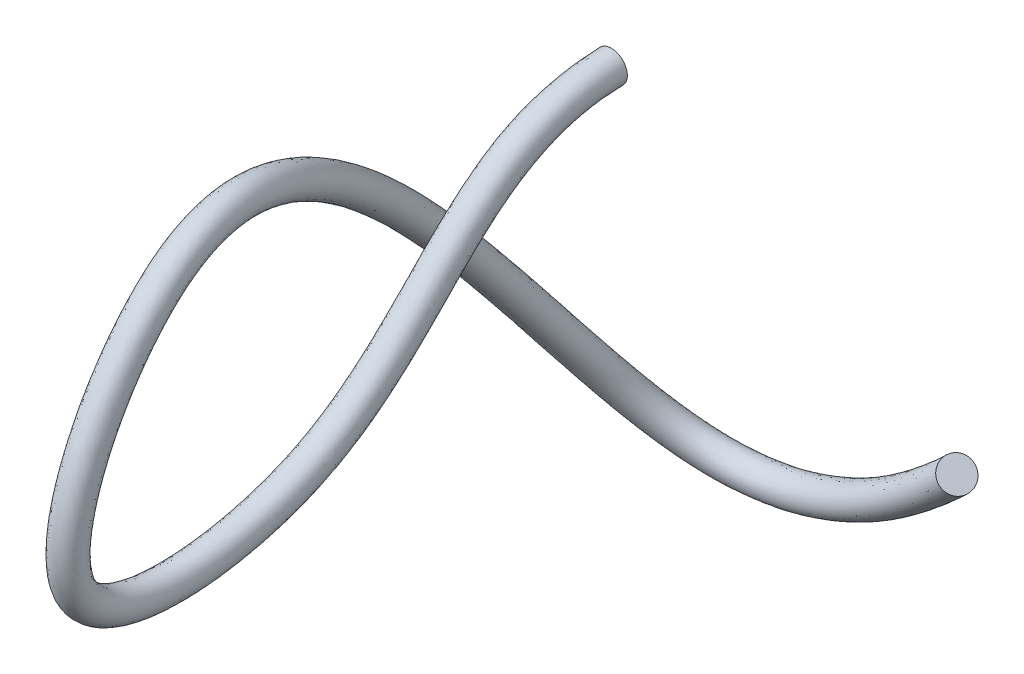
ISO-10303-21;
HEADER;
FILE_DESCRIPTION(('STEP AP214'),'2;1');
FILE_NAME('part.step','',(''),(''),'','','');
FILE_SCHEMA(('AUTOMOTIVE_DESIGN { 1 0 10303 214 1 1 1 1 }'));
ENDSEC;
DATA;
#1=APPLICATION_CONTEXT('core data for automotive mechanical design processes');
#2=APPLICATION_PROTOCOL_DEFINITION('international standard','automotive_design',2000,#1);
#3=PRODUCT_CONTEXT('',#1,'mechanical');
#4=PRODUCT('Part','Part','',(#3));
#5=PRODUCT_RELATED_PRODUCT_CATEGORY('part','',(#4));
#6=PRODUCT_DEFINITION_FORMATION('','',#4);
#7=PRODUCT_DEFINITION_CONTEXT('part definition',#1,'design');
#8=PRODUCT_DEFINITION('design','',#6,#7);
#9=PRODUCT_DEFINITION_SHAPE('','',#8);
#10=(LENGTH_UNIT() NAMED_UNIT(*) SI_UNIT(.MILLI.,.METRE.));
#11=(NAMED_UNIT(*) PLANE_ANGLE_UNIT() SI_UNIT($,.RADIAN.));
#12=(NAMED_UNIT(*) SI_UNIT($,.STERADIAN.) SOLID_ANGLE_UNIT());
#13=UNCERTAINTY_MEASURE_WITH_UNIT(LENGTH_MEASURE(1.E-05),#10,'distance_accuracy_value','');
#14=(GEOMETRIC_REPRESENTATION_CONTEXT(3) GLOBAL_UNCERTAINTY_ASSIGNED_CONTEXT((#13)) GLOBAL_UNIT_ASSIGNED_CONTEXT((#10,
#11,#12)) REPRESENTATION_CONTEXT('',''));
#15=CARTESIAN_POINT('',(0.,0.,0.));
#16=DIRECTION('',(0.,0.,1.));
#17=DIRECTION('',(1.,0.,0.));
#18=AXIS2_PLACEMENT_3D('',#15,#16,#17);
#19=CARTESIAN_POINT('',(335.309726891011,-178.374330476018,-1.599378925278));
#20=DIRECTION('',(0.690028986622815,0.673712878655407,0.264520235056103));
#21=DIRECTION('',(0.723689115795958,-0.636366354079352,-0.267042931144447));
#22=AXIS2_PLACEMENT_3D('',#19,#20,#21);
#23=PLANE('',#22);
#24=CARTESIAN_POINT('',(335.309726891011,-178.374330476018,-1.599378925278));
#25=DIRECTION('',(0.690028986622815,0.673712878655407,0.264520235056103));
#26=DIRECTION('',(0.723689115795958,-0.636366354079352,-0.267042931144447));
#27=AXIS2_PLACEMENT_3D('',#24,#25,#26);
#28=CIRCLE('',#27,15.308456730718);
#29=CARTESIAN_POINT('',(346.388290406665,-188.116117272327,-5.68739408194688));
#30=VERTEX_POINT('',#29);
#31=EDGE_CURVE('E42',#30,#30,#28,.T.);
#32=ORIENTED_EDGE('',*,*,#31,.T.);
#33=EDGE_LOOP('',(#32));
#34=FACE_BOUND('',#33,.T.);
#35=ADVANCED_FACE('F39',(#34),#23,.T.);
#36=CARTESIAN_POINT('',(0.,0.,0.));
#37=DIRECTION('',(-0.00204290912862575,-0.0240600520342784,0.999708427701998));
#38=DIRECTION('',(0.,-0.999710513838946,-0.024060102241481));
#39=AXIS2_PLACEMENT_3D('',#36,#37,#38);
#40=PLANE('',#39);
#41=CARTESIAN_POINT('',(0.,0.,0.));
#42=DIRECTION('',(-0.00204290912862575,-0.0240600520342784,0.999708427701998));
#43=DIRECTION('',(0.,-0.999710513838946,-0.024060102241481));
#44=AXIS2_PLACEMENT_3D('',#41,#42,#43);
#45=CIRCLE('',#44,15.308456730718);
#46=CARTESIAN_POINT('',(0.,-15.3040251443474,-0.368323034100364));
#47=VERTEX_POINT('',#46);
#48=EDGE_CURVE('E11',#47,#47,#45,.T.);
#49=ORIENTED_EDGE('',*,*,#48,.F.);
#50=EDGE_LOOP('',(#49));
#51=FACE_BOUND('',#50,.T.);
#52=ADVANCED_FACE('F54',(#51),#40,.F.);
#53=CARTESIAN_POINT('',(0.,-15.3040251443474,-0.368323034100364));
#54=CARTESIAN_POINT('',(-0.0488518499919421,-15.8793703891785,23.5375891092513));
#55=CARTESIAN_POINT('',(-0.14959538035037,-25.1741192621852,67.7214950165616));
#56=CARTESIAN_POINT('',(0.134784750765124,-56.0848180485122,116.106025080805));
#57=CARTESIAN_POINT('',(-0.680773213094822,-99.3402270469971,160.683034221036));
#58=CARTESIAN_POINT('',(-0.328992401062355,-142.556232409218,202.056970033933));
#59=CARTESIAN_POINT('',(-0.547023129413974,-178.493776254683,245.104514422233));
#60=CARTESIAN_POINT('',(-0.642966008514093,-205.403423082113,289.239783524711));
#61=CARTESIAN_POINT('',(-1.12067128384425,-223.682145254534,337.760868099379));
#62=CARTESIAN_POINT('',(-1.50664719064338,-234.092242072546,384.095118738764));
#63=CARTESIAN_POINT('',(-1.78746558990886,-238.031996650566,425.519227076928));
#64=CARTESIAN_POINT('',(-1.91979610276785,-235.687783028323,464.614107996682));
#65=CARTESIAN_POINT('',(-1.85548555266158,-227.677189656734,493.1086140156));
#66=CARTESIAN_POINT('',(-1.67098562754373,-217.064520405097,512.254198158919));
#67=CARTESIAN_POINT('',(-1.46714929616952,-207.424504311676,524.150772490505));
#68=CARTESIAN_POINT('',(-1.20147870477028,-195.389653263534,533.974376914415));
#69=CARTESIAN_POINT('',(-0.757500509447329,-181.507162813717,540.935688083387));
#70=CARTESIAN_POINT('',(-0.294324024822294,-166.555092990874,545.190684966454));
#71=CARTESIAN_POINT('',(0.372731012669453,-145.54448807081,547.760557933726));
#72=CARTESIAN_POINT('',(1.24483187302487,-117.781862824723,545.919701904035));
#73=CARTESIAN_POINT('',(2.25473384697316,-83.1965389102575,537.281961789196));
#74=CARTESIAN_POINT('',(3.1837752527356,-44.7641412975349,521.744595838021));
#75=CARTESIAN_POINT('',(3.66724262979808,-4.54388781117632,498.331856471621));
#76=CARTESIAN_POINT('',(3.12461994087111,33.2117240063784,466.900626344073));
#77=CARTESIAN_POINT('',(0.865117926435359,58.6042934720493,433.799876585823));
#78=CARTESIAN_POINT('',(-2.92430763310028,71.6505142715317,401.701254926037));
#79=CARTESIAN_POINT('',(-6.91920764677951,76.1964287201585,371.940176441203));
#80=CARTESIAN_POINT('',(-11.3894850540167,74.1565499883593,342.039719358185));
#81=CARTESIAN_POINT('',(-18.7137678528839,62.148962650525,295.927432156922));
#82=CARTESIAN_POINT('',(-28.9706576667048,27.2373190778554,234.857754952741));
#83=CARTESIAN_POINT('',(-40.6780365504354,-39.3570792382523,161.754215973301));
#84=CARTESIAN_POINT('',(-47.3391118396447,-120.354624611115,97.02023664499));
#85=CARTESIAN_POINT('',(-40.7485733536217,-193.949958638277,47.3080552414139));
#86=CARTESIAN_POINT('',(-24.7265384211896,-251.204435236461,8.97178365813537));
#87=CARTESIAN_POINT('',(-6.79586175913062,-286.09510952238,-14.5304639258659));
#88=CARTESIAN_POINT('',(12.4957122768009,-308.992323827687,-30.5028953933863));
#89=CARTESIAN_POINT('',(29.8006448113158,-323.160841230499,-40.8587980165747));
#90=CARTESIAN_POINT('',(50.1951589591678,-333.63882036586,-49.2752807178128));
#91=CARTESIAN_POINT('',(72.0073611675148,-339.218927733635,-54.9318540801275));
#92=CARTESIAN_POINT('',(94.1971760567243,-340.448707282193,-58.1114898061686));
#93=CARTESIAN_POINT('',(116.035966607634,-338.243509382492,-59.3085902085252));
#94=CARTESIAN_POINT('',(139.174898431094,-332.645652025911,-58.777368787835));
#95=CARTESIAN_POINT('',(163.614042127785,-323.659870113038,-56.5649434205391));
#96=CARTESIAN_POINT('',(202.755774150178,-304.600988389675,-50.573654346452));
#97=CARTESIAN_POINT('',(258.241149592704,-268.542468693136,-37.5392130052238));
#98=CARTESIAN_POINT('',(320.111767718809,-213.771317393313,-15.7604085387268));
#99=CARTESIAN_POINT('',(346.388290406665,-188.116117272327,-5.68739408194688));
#100=CARTESIAN_POINT('',(30.6168495718665,-15.3055300453247,-0.305793568756153));
#101=CARTESIAN_POINT('',(30.5569579372302,-16.0108946773462,29.0024957994523));
#102=CARTESIAN_POINT('',(30.4698883086519,-25.212842102425,65.1072455120974));
#103=CARTESIAN_POINT('',(30.7592416839728,-55.9034340071057,116.917910139796));
#104=CARTESIAN_POINT('',(29.9012614903135,-100.455001358939,159.274424758302));
#105=CARTESIAN_POINT('',(30.2677748595015,-143.329678445399,201.310068038836));
#106=CARTESIAN_POINT('',(30.0367683692935,-179.689867677273,244.293886775596));
#107=CARTESIAN_POINT('',(29.9448783998565,-206.672734030458,288.769748660059));
#108=CARTESIAN_POINT('',(29.4448396892096,-225.435347354769,337.385850272763));
#109=CARTESIAN_POINT('',(29.0390705463443,-236.177169660068,383.892088757145));
#110=CARTESIAN_POINT('',(28.7403202952468,-240.374854230193,425.53532740284));
#111=CARTESIAN_POINT('',(28.5941193013495,-238.1834137866,464.959179659543));
#112=CARTESIAN_POINT('',(28.6520962613794,-230.167483317296,493.850834808808));
#113=CARTESIAN_POINT('',(28.8360511869781,-219.403517156866,513.384574463714));
#114=CARTESIAN_POINT('',(29.0427548689911,-209.569719832005,525.560382154121));
#115=CARTESIAN_POINT('',(29.3118018389888,-197.254767733231,535.681354025328));
#116=CARTESIAN_POINT('',(29.7772772507084,-182.954177286602,542.661415482242));
#117=CARTESIAN_POINT('',(30.2573958208171,-167.669048505695,546.858203600165));
#118=CARTESIAN_POINT('',(30.947500757029,-146.288137248676,549.210948028973));
#119=CARTESIAN_POINT('',(31.844709418753,-118.238021922613,546.91489936645));
#120=CARTESIAN_POINT('',(32.8727295531779,-83.5543170912664,537.508876959363));
#121=CARTESIAN_POINT('',(33.7932691055762,-45.2583563897132,520.954599373149));
#122=CARTESIAN_POINT('',(34.2217173537796,-5.38462889721677,496.412896987303));
#123=CARTESIAN_POINT('',(33.5703910659824,31.869437749661,463.921861372367));
#124=CARTESIAN_POINT('',(31.2554823333839,57.2805092030945,430.306822124212));
#125=CARTESIAN_POINT('',(27.4764339001849,71.1657370863699,398.07382323641));
#126=CARTESIAN_POINT('',(23.4418431766629,76.315070923411,367.970731250051));
#127=CARTESIAN_POINT('',(18.9081468344593,74.9758581638102,337.677356704806));
#128=CARTESIAN_POINT('',(11.4159079388002,64.2496077884131,290.779562028248));
#129=CARTESIAN_POINT('',(0.640041598029568,31.8460597654182,228.082284742494));
#130=CARTESIAN_POINT('',(-13.6757953757835,-28.506179498291,149.670514719095));
#131=CARTESIAN_POINT('',(-31.3391179650489,-101.944316469087,76.3989687544303));
#132=CARTESIAN_POINT('',(-36.168641509733,-174.809205447103,23.4443079995226));
#133=CARTESIAN_POINT('',(-25.3917836398115,-233.313453727871,-15.9381435822897));
#134=CARTESIAN_POINT('',(-9.51153129221093,-269.339145299361,-40.0299165466727));
#135=CARTESIAN_POINT('',(8.93325988077903,-293.183653658921,-56.4848487170671));
#136=CARTESIAN_POINT('',(25.9480814703135,-308.05547668756,-67.2138222094825));
#137=CARTESIAN_POINT('',(46.3594559447161,-319.189228260021,-75.9972288818674));
#138=CARTESIAN_POINT('',(68.4062722300854,-325.289901686519,-81.9601584166091));
#139=CARTESIAN_POINT('',(90.9141546272828,-326.910867829198,-85.3773182984324));
#140=CARTESIAN_POINT('',(113.078897973713,-325.00459912926,-86.7577322714566));
#141=CARTESIAN_POINT('',(136.554677856495,-319.659524220615,-86.3807524198464));
#142=CARTESIAN_POINT('',(161.308438009511,-310.914458108477,-84.3086417779838));
#143=CARTESIAN_POINT('',(201.017052162271,-292.127140368961,-78.4817845899939));
#144=CARTESIAN_POINT('',(256.359657272936,-257.020684127061,-65.8727601789979));
#145=CARTESIAN_POINT('',(320.973320487228,-201.081314974836,-43.6660122526285));
#146=CARTESIAN_POINT('',(346.033792954745,-176.613410910127,-34.0591664588475));
#147=CARTESIAN_POINT('',(30.6168495718665,15.3025202433701,0.430852499444574));
#148=CARTESIAN_POINT('',(30.5569579372302,14.5971556113486,29.7391418676531));
#149=CARTESIAN_POINT('',(30.5941310160731,3.70076780403699,78.6297486774459));
#150=CARTESIAN_POINT('',(30.5171048825406,-32.3439846633761,136.441776379238));
#151=CARTESIAN_POINT('',(31.562449683123,-79.6103320344997,181.720897455903));
#152=CARTESIAN_POINT('',(31.3592904962908,-121.303041081385,222.608705322435));
#153=CARTESIAN_POINT('',(31.468357407978,-154.867398639002,262.382961016448));
#154=CARTESIAN_POINT('',(31.280691717415,-178.945291931846,302.089232851234));
#155=CARTESIAN_POINT('',(31.2264696942884,-196.074219410304,346.22263518929));
#156=CARTESIAN_POINT('',(31.1254050276619,-205.957999808451,388.841666189032));
#157=CARTESIAN_POINT('',(31.0771184659861,-209.742614292726,426.359693179905));
#158=CARTESIAN_POINT('',(31.1056351233088,-207.797328332077,460.403898661275));
#159=CARTESIAN_POINT('',(31.2331968465472,-201.332432146312,482.954558839815));
#160=CARTESIAN_POINT('',(31.4038296685932,-193.915221665011,496.335336408738));
#161=CARTESIAN_POINT('',(31.551530695147,-187.711028385487,503.95059960627));
#162=CARTESIAN_POINT('',(31.7461688761326,-180.650875979466,509.775427100971));
#163=CARTESIAN_POINT('',(31.8955605998842,-172.052444737272,513.933815843267));
#164=CARTESIAN_POINT('',(32.10053241889,-161.816618305589,516.737985278135));
#165=CARTESIAN_POINT('',(32.3869211132629,-146.153556124005,518.427259955927));
#166=CARTESIAN_POINT('',(32.7357556227717,-123.389351397682,516.594377476723));
#167=CARTESIAN_POINT('',(32.9644929102669,-93.2301498783689,508.358297913953));
#168=CARTESIAN_POINT('',(32.8499477657317,-58.9111349599233,493.443135504137));
#169=CARTESIAN_POINT('',(32.144854589207,-22.8669692783205,471.206980547963));
#170=CARTESIAN_POINT('',(30.4596737767525,10.1370077536902,442.206765761209));
#171=CARTESIAN_POINT('',(28.2624781010423,30.6225116085394,414.757593982578));
#172=CARTESIAN_POINT('',(26.0060622870409,41.3557141731815,390.013612107821));
#173=CARTESIAN_POINT('',(23.3851386550231,45.4721785676706,366.842699906194));
#174=CARTESIAN_POINT('',(20.4202018288188,44.6147881607569,342.614847882274));
#175=CARTESIAN_POINT('',(15.438761644319,36.0150769822491,303.073294221451));
#176=CARTESIAN_POINT('',(8.41188835144395,7.51951966305109,245.4858787771));
#177=CARTESIAN_POINT('',(2.57534117730503,-47.9821439951805,168.502528362211));
#178=CARTESIAN_POINT('',(-3.68500052970755,-111.407850856229,89.4237008766689));
#179=CARTESIAN_POINT('',(-5.80847456282097,-174.139557211107,29.8328071651943));
#180=CARTESIAN_POINT('',(4.04547995626338,-225.596880985481,-11.1543544687379));
#181=CARTESIAN_POINT('',(17.8067628900273,-256.184993812976,-34.259948778772));
#182=CARTESIAN_POINT('',(32.5739342492785,-275.085425698181,-48.6921070549725));
#183=CARTESIAN_POINT('',(45.3647481257624,-286.151757826375,-57.465543150984));
#184=CARTESIAN_POINT('',(59.8308319193942,-293.960725429988,-64.2478330848137));
#185=CARTESIAN_POINT('',(75.1682211339359,-298.176329984646,-68.8550715470139));
#186=CARTESIAN_POINT('',(91.4450277901455,-299.327853202258,-71.7245614040771));
#187=CARTESIAN_POINT('',(108.442525291713,-297.836348859812,-73.1378252337641));
#188=CARTESIAN_POINT('',(127.605809718247,-293.422654764899,-73.1788473559451));
#189=CARTESIAN_POINT('',(148.917017565009,-285.820097920388,-71.7366451334481));
#190=CARTESIAN_POINT('',(184.527588919516,-268.831579863681,-67.0477558083607));
#191=CARTESIAN_POINT('',(236.82032673927,-235.538093165586,-55.7128948846063));
#192=CARTESIAN_POINT('',(298.81619345592,-181.597741382219,-35.4899819392908));
#193=CARTESIAN_POINT('',(323.876665923437,-157.12983731751,-25.8831361455098));
#194=CARTESIAN_POINT('',(0.,15.3040251443474,0.368323034100364));
#195=CARTESIAN_POINT('',(-0.0543717423140993,14.6636702059211,26.9754237898804));
#196=CARTESIAN_POINT('',(-0.0227906786983213,3.76966414227632,79.9902727036588));
#197=CARTESIAN_POINT('',(-0.10803919199186,-32.5334614073883,135.966147575483));
#198=CARTESIAN_POINT('',(0.980601550782823,-78.4933604101342,183.03820737594));
#199=CARTESIAN_POINT('',(0.762491394336362,-120.529970052346,223.371189071055));
#200=CARTESIAN_POINT('',(0.88457295733155,-153.671224208943,263.190139656993));
#201=CARTESIAN_POINT('',(0.692845402554842,-177.676003436892,302.560200666675));
#202=CARTESIAN_POINT('',(0.660959092099533,-194.321012942262,346.59747153116));
#203=CARTESIAN_POINT('',(0.579687203561232,-203.87307324689,389.044738799859));
#204=CARTESIAN_POINT('',(0.549332604215231,-207.399756437688,426.343581410515));
#205=CARTESIAN_POINT('',(0.591719712765204,-205.301697649484,460.058830143123));
#206=CARTESIAN_POINT('',(0.725615033206563,-198.842138477501,482.212337703856));
#207=CARTESIAN_POINT('',(0.896792853948548,-191.576224914688,495.204960164036));
#208=CARTESIAN_POINT('',(1.04162653001928,-185.565812864771,502.540989926552));
#209=CARTESIAN_POINT('',(1.23288833236469,-178.785761509872,508.068449994372));
#210=CARTESIAN_POINT('',(1.36078283973083,-170.605430264359,512.208088443259));
#211=CARTESIAN_POINT('',(1.54881257325003,-160.702662790776,515.070466644726));
#212=CARTESIAN_POINT('',(1.81215136890371,-145.409906946135,516.976869860506));
#213=CARTESIAN_POINT('',(2.13587807704354,-122.933192299794,515.599180014367));
#214=CARTESIAN_POINT('',(2.34649720406213,-92.8723716973596,508.131382743769));
#215=CARTESIAN_POINT('',(2.24045391289109,-58.4169198677451,494.233131969015));
#216=CARTESIAN_POINT('',(1.59037986522538,-22.0262281922801,473.125940032278));
#217=CARTESIAN_POINT('',(0.0139026516413384,11.4792940104078,445.185530732916));
#218=CARTESIAN_POINT('',(-2.12788630590669,31.9462958774938,418.250648444189));
#219=CARTESIAN_POINT('',(-4.39467924624311,41.8404913583445,393.641043797449));
#220=CARTESIAN_POINT('',(-6.97591216842381,45.3535363644137,370.812145097344));
#221=CARTESIAN_POINT('',(-9.87743005964053,43.7954799853223,346.97721053566));
#222=CARTESIAN_POINT('',(-14.6909141474711,33.9144318442574,308.221164350084));
#223=CARTESIAN_POINT('',(-21.1988109121182,2.9107789766328,252.261348987797));
#224=CARTESIAN_POINT('',(-24.4269000015933,-58.8330437392878,180.58622961479));
#225=CARTESIAN_POINT('',(-19.6849943884897,-129.818158982817,110.044968773291));
#226=CARTESIAN_POINT('',(-10.3884064574042,-193.280310451777,53.6965543876521));
#227=CARTESIAN_POINT('',(4.71072529547209,-243.487862376335,13.7555728179137));
#228=CARTESIAN_POINT('',(20.5224320631044,-272.940958387486,-8.76049629597122));
#229=CARTESIAN_POINT('',(36.1363872691888,-290.894095257811,-22.7101534921263));
#230=CARTESIAN_POINT('',(49.2173090852413,-301.257124694525,-31.1105198710249));
#231=CARTESIAN_POINT('',(63.666543836051,-308.410308844119,-37.5258815081294));
#232=CARTESIAN_POINT('',(78.769279652702,-312.105385731159,-41.826778871422));
#233=CARTESIAN_POINT('',(94.7281377924376,-312.865606176755,-44.4586989577162));
#234=CARTESIAN_POINT('',(111.399260899702,-311.075584264398,-45.6888108351766));
#235=CARTESIAN_POINT('',(130.227273823723,-306.407568443276,-45.5749870206553));
#236=CARTESIAN_POINT('',(151.217980585704,-298.57004128127,-43.994725924773));
#237=CARTESIAN_POINT('',(186.294612745369,-281.277795258688,-39.1287761527346));
#238=CARTESIAN_POINT('',(238.410306762827,-247.344497062228,-27.4910979454028));
#239=CARTESIAN_POINT('',(298.562665797671,-193.694095772557,-7.35129389388959));
#240=CARTESIAN_POINT('',(324.231163375357,-168.63254367971,2.48863623139088));
#241=CARTESIAN_POINT('',(-30.6168495718665,15.3055300453247,0.305793568756153));
#242=CARTESIAN_POINT('',(-30.6657014218584,14.7301848004936,24.2117057121078));
#243=CARTESIAN_POINT('',(-30.6397123734698,3.83856048051566,81.3507967298717));
#244=CARTESIAN_POINT('',(-30.7331832665243,-32.7229381514006,135.490518771729));
#245=CARTESIAN_POINT('',(-29.6012465815574,-77.3763887857686,184.355517295977));
#246=CARTESIAN_POINT('',(-29.834307707618,-119.756899023307,224.133672819675));
#247=CARTESIAN_POINT('',(-29.6992114933149,-152.475049778884,263.997318297538));
#248=CARTESIAN_POINT('',(-29.8950009123053,-176.406714941939,303.031168482116));
#249=CARTESIAN_POINT('',(-29.9045515100893,-192.567806474221,346.97230787303));
#250=CARTESIAN_POINT('',(-29.9660306205394,-201.788146685329,389.247811410685));
#251=CARTESIAN_POINT('',(-29.9784532575556,-205.05689858265,426.327469641124));
#252=CARTESIAN_POINT('',(-29.9221956977784,-202.806066966891,459.71376162497));
#253=CARTESIAN_POINT('',(-29.781966780134,-196.35184480869,481.470116567897));
#254=CARTESIAN_POINT('',(-29.6102439606961,-189.237228164366,494.074583919334));
#255=CARTESIAN_POINT('',(-29.4682776351085,-183.420597344054,501.131380246834));
#256=CARTESIAN_POINT('',(-29.2803922114032,-176.920647040279,506.361472887774));
#257=CARTESIAN_POINT('',(-29.1739949204225,-169.158415791447,510.48236104325));
#258=CARTESIAN_POINT('',(-29.0029072723899,-159.588707275962,513.402948011317));
#259=CARTESIAN_POINT('',(-28.7626183754555,-144.666257768264,515.526479765085));
#260=CARTESIAN_POINT('',(-28.4639994686847,-122.477033201907,514.603982552012));
#261=CARTESIAN_POINT('',(-28.2714985021426,-92.5145935163503,507.904467573586));
#262=CARTESIAN_POINT('',(-28.3690399399495,-57.9227047755669,495.023128433894));
#263=CARTESIAN_POINT('',(-28.9640948587562,-21.1854871062396,475.044899516595));
#264=CARTESIAN_POINT('',(-30.4318684734698,12.8215802671253,448.164295704622));
#265=CARTESIAN_POINT('',(-32.5182507128556,33.2700801464481,421.7437029058));
#266=CARTESIAN_POINT('',(-34.795420779527,42.3252685435075,397.268475487077));
#267=CARTESIAN_POINT('',(-37.3369629918707,45.2348941611568,374.781590288494));
#268=CARTESIAN_POINT('',(-40.1750619480998,42.9761718098878,351.339573189046));
#269=CARTESIAN_POINT('',(-44.8205899392613,31.8137867062657,313.369034478717));
#270=CARTESIAN_POINT('',(-50.8095101756803,-1.69796170978547,259.036819198494));
#271=CARTESIAN_POINT('',(-51.4291411804916,-69.6839434833951,192.669930867368));
#272=CARTESIAN_POINT('',(-35.6849882472717,-148.228467109406,130.666236669913));
#273=CARTESIAN_POINT('',(-14.9683383519875,-212.421063692447,77.5603016101098));
#274=CARTESIAN_POINT('',(5.37597063468082,-261.37884376719,38.6655001045653));
#275=CARTESIAN_POINT('',(23.2381012361815,-289.696922961995,16.7389561868296));
#276=CARTESIAN_POINT('',(39.6988402890991,-306.702764817441,3.27180007072002));
#277=CARTESIAN_POINT('',(53.0698700447203,-316.362491562675,-4.75549659106591));
#278=CARTESIAN_POINT('',(67.5022557527077,-322.859892258251,-10.8039299314451));
#279=CARTESIAN_POINT('',(82.370338171468,-326.034441477673,-14.7984861958302));
#280=CARTESIAN_POINT('',(98.0112477947298,-326.403359151253,-17.1928365113553));
#281=CARTESIAN_POINT('',(114.355996507691,-324.314819668985,-18.2397964365892));
#282=CARTESIAN_POINT('',(132.8487379292,-319.392482121654,-17.9711266853656));
#283=CARTESIAN_POINT('',(153.518943606399,-311.319984642151,-16.2528067160978));
#284=CARTESIAN_POINT('',(188.061636571222,-293.724010653695,-11.2097964971084));
#285=CARTESIAN_POINT('',(240.000286786384,-259.150900958869,0.73069899380071));
#286=CARTESIAN_POINT('',(298.309138139421,-205.790450162896,20.7873941515116));
#287=CARTESIAN_POINT('',(324.585660827278,-180.135250041909,30.8604086082915));
#288=CARTESIAN_POINT('',(-30.6168495718665,-15.3025202433701,-0.430852499444574));
#289=CARTESIAN_POINT('',(-30.6546616372141,-15.7478461010108,18.0726824190502));
#290=CARTESIAN_POINT('',(-30.7690790693527,-25.1353964219455,70.3357445210258));
#291=CARTESIAN_POINT('',(-30.4896721824426,-56.2662020899188,115.294140021814));
#292=CARTESIAN_POINT('',(-31.2628079165032,-98.225452735055,162.091643683769));
#293=CARTESIAN_POINT('',(-30.9257596616262,-141.782786373036,202.80387202903));
#294=CARTESIAN_POINT('',(-31.1308146281214,-177.297684832092,245.91514206887));
#295=CARTESIAN_POINT('',(-31.2308104168846,-204.134112133768,289.709818389362));
#296=CARTESIAN_POINT('',(-31.6861822568981,-221.928943154298,338.135885925994));
#297=CARTESIAN_POINT('',(-32.0523649276311,-232.007314485025,384.298148720384));
#298=CARTESIAN_POINT('',(-32.3152514750645,-235.689139070939,425.503126751017));
#299=CARTESIAN_POINT('',(-32.4337115068852,-233.192152270046,464.269036333821));
#300=CARTESIAN_POINT('',(-32.3630673667026,-225.186895996172,492.366393222392));
#301=CARTESIAN_POINT('',(-32.1780224420656,-214.725523653329,511.123821854125));
#302=CARTESIAN_POINT('',(-31.9770534613302,-205.279288791347,522.741162826889));
#303=CARTESIAN_POINT('',(-31.7147592485294,-193.524538793837,532.267399803503));
#304=CARTESIAN_POINT('',(-31.292278269603,-180.060148340833,539.209960684533));
#305=CARTESIAN_POINT('',(-30.8460438704617,-165.441137476054,543.523166332742));
#306=CARTESIAN_POINT('',(-30.2020387316901,-144.800838892944,546.31016783848));
#307=CARTESIAN_POINT('',(-29.3550456727032,-117.325703726834,544.92450444162));
#308=CARTESIAN_POINT('',(-28.3632618592316,-82.8387607292486,537.055046619028));
#309=CARTESIAN_POINT('',(-27.425718600105,-44.2699262053566,522.534592302894));
#310=CARTESIAN_POINT('',(-26.8872320941834,-3.70314672513587,500.250815955939));
#311=CARTESIAN_POINT('',(-27.3211511842402,34.5540102630958,469.879391315779));
#312=CARTESIAN_POINT('',(-29.5252464805131,59.928077741004,437.292931047435));
#313=CARTESIAN_POINT('',(-33.3250491663854,72.1352914566936,405.328686615664));
#314=CARTESIAN_POINT('',(-37.2802584702219,76.077786516906,375.909621632355));
#315=CARTESIAN_POINT('',(-41.6871169424927,73.3372418129085,346.402082011565));
#316=CARTESIAN_POINT('',(-48.8434436445679,60.0483175126368,301.075302285596));
#317=CARTESIAN_POINT('',(-58.5813569314392,22.6285783902926,241.633225162989));
#318=CARTESIAN_POINT('',(-67.6802777250872,-50.2079789782135,173.837917227507));
#319=CARTESIAN_POINT('',(-63.3391057142404,-138.764932753144,117.64150453555));
#320=CARTESIAN_POINT('',(-45.3285051975104,-213.090711829451,71.1718024833052));
#321=CARTESIAN_POINT('',(-24.0612932025676,-269.095416745051,33.8817108985604));
#322=CARTESIAN_POINT('',(-4.08019222605032,-302.851073745398,10.9689886949409));
#323=CARTESIAN_POINT('',(16.0581646728228,-324.800993996454,-4.52094206970551));
#324=CARTESIAN_POINT('',(33.6532081523181,-338.266205773438,-14.5037738236669));
#325=CARTESIAN_POINT('',(54.0308619736196,-348.088412471699,-22.5533325537581));
#326=CARTESIAN_POINT('',(75.6084501049441,-353.147953780751,-27.9035497436459));
#327=CARTESIAN_POINT('',(97.480197486166,-353.986546735188,-30.8456613139049));
#328=CARTESIAN_POINT('',(118.993035241555,-351.482419635724,-31.8594481455939));
#329=CARTESIAN_POINT('',(141.795119005693,-345.631779831207,-31.1739851558236));
#330=CARTESIAN_POINT('',(165.919646246059,-336.405282117598,-28.8212450630945));
#331=CARTESIAN_POINT('',(204.494496138085,-317.074836410388,-22.6655241029101));
#332=CARTESIAN_POINT('',(260.122641912472,-280.064253259211,-9.20566583144962));
#333=CARTESIAN_POINT('',(319.250214950389,-226.461319811791,12.1451951751749));
#334=CARTESIAN_POINT('',(346.742787858586,-199.618823634526,22.6843782949538));
#335=CARTESIAN_POINT('',(0.,-15.3040251443474,-0.368323034100364));
#336=CARTESIAN_POINT('',(-0.0488518499919421,-15.8793703891785,23.5375891092513));
#337=CARTESIAN_POINT('',(-0.14959538035037,-25.1741192621852,67.7214950165616));
#338=CARTESIAN_POINT('',(0.134784750765124,-56.0848180485122,116.106025080805));
#339=CARTESIAN_POINT('',(-0.680773213094822,-99.3402270469971,160.683034221036));
#340=CARTESIAN_POINT('',(-0.328992401062355,-142.556232409218,202.056970033933));
#341=CARTESIAN_POINT('',(-0.547023129413974,-178.493776254683,245.104514422233));
#342=CARTESIAN_POINT('',(-0.642966008514093,-205.403423082113,289.239783524711));
#343=CARTESIAN_POINT('',(-1.12067128384425,-223.682145254534,337.760868099379));
#344=CARTESIAN_POINT('',(-1.50664719064338,-234.092242072546,384.095118738764));
#345=CARTESIAN_POINT('',(-1.78746558990886,-238.031996650566,425.519227076928));
#346=CARTESIAN_POINT('',(-1.91979610276785,-235.687783028323,464.614107996682));
#347=CARTESIAN_POINT('',(-1.85548555266158,-227.677189656734,493.1086140156));
#348=CARTESIAN_POINT('',(-1.67098562754373,-217.064520405097,512.254198158919));
#349=CARTESIAN_POINT('',(-1.46714929616952,-207.424504311676,524.150772490505));
#350=CARTESIAN_POINT('',(-1.20147870477028,-195.389653263534,533.974376914415));
#351=CARTESIAN_POINT('',(-0.757500509447329,-181.507162813717,540.935688083387));
#352=CARTESIAN_POINT('',(-0.294324024822294,-166.555092990874,545.190684966454));
#353=CARTESIAN_POINT('',(0.372731012669453,-145.54448807081,547.760557933726));
#354=CARTESIAN_POINT('',(1.24483187302487,-117.781862824723,545.919701904035));
#355=CARTESIAN_POINT('',(2.25473384697316,-83.1965389102575,537.281961789196));
#356=CARTESIAN_POINT('',(3.1837752527356,-44.7641412975349,521.744595838021));
#357=CARTESIAN_POINT('',(3.66724262979808,-4.54388781117632,498.331856471621));
#358=CARTESIAN_POINT('',(3.12461994087111,33.2117240063784,466.900626344073));
#359=CARTESIAN_POINT('',(0.865117926435359,58.6042934720493,433.799876585823));
#360=CARTESIAN_POINT('',(-2.92430763310028,71.6505142715317,401.701254926037));
#361=CARTESIAN_POINT('',(-6.91920764677951,76.1964287201585,371.940176441203));
#362=CARTESIAN_POINT('',(-11.3894850540167,74.1565499883593,342.039719358185));
#363=CARTESIAN_POINT('',(-18.7137678528839,62.148962650525,295.927432156922));
#364=CARTESIAN_POINT('',(-28.9706576667048,27.2373190778554,234.857754952741));
#365=CARTESIAN_POINT('',(-40.6780365504354,-39.3570792382523,161.754215973301));
#366=CARTESIAN_POINT('',(-47.3391118396447,-120.354624611115,97.02023664499));
#367=CARTESIAN_POINT('',(-40.7485733536217,-193.949958638277,47.3080552414139));
#368=CARTESIAN_POINT('',(-24.7265384211896,-251.204435236461,8.97178365813537));
#369=CARTESIAN_POINT('',(-6.79586175913062,-286.09510952238,-14.5304639258659));
#370=CARTESIAN_POINT('',(12.4957122768009,-308.992323827687,-30.5028953933863));
#371=CARTESIAN_POINT('',(29.8006448113158,-323.160841230499,-40.8587980165747));
#372=CARTESIAN_POINT('',(50.1951589591678,-333.63882036586,-49.2752807178128));
#373=CARTESIAN_POINT('',(72.0073611675148,-339.218927733635,-54.9318540801275));
#374=CARTESIAN_POINT('',(94.1971760567243,-340.448707282193,-58.1114898061686));
#375=CARTESIAN_POINT('',(116.035966607634,-338.243509382492,-59.3085902085252));
#376=CARTESIAN_POINT('',(139.174898431094,-332.645652025911,-58.777368787835));
#377=CARTESIAN_POINT('',(163.614042127785,-323.659870113038,-56.5649434205391));
#378=CARTESIAN_POINT('',(202.755774150178,-304.600988389675,-50.573654346452));
#379=CARTESIAN_POINT('',(258.241149592704,-268.542468693136,-37.5392130052238));
#380=CARTESIAN_POINT('',(320.111767718809,-213.771317393313,-15.7604085387268));
#381=CARTESIAN_POINT('',(346.388290406665,-188.116117272327,-5.68739408194688));
#382=(BOUNDED_SURFACE() B_SPLINE_SURFACE(3,3,((#53,#54,#55,#56,#57,#58,#59,#60,#61,#62,#63,#64,
#65,#66,#67,#68,#69,#70,#71,#72,#73,#74,#75,#76,#77,#78,#79,#80,#81,#82,#83,#84,#85,#86,#87,#88,
#89,#90,#91,#92,#93,#94,#95,#96,#97,#98,#99),(#100,#101,#102,#103,#104,#105,#106,#107,#108,#109,
#110,#111,#112,#113,#114,#115,#116,#117,#118,#119,#120,#121,#122,#123,#124,#125,#126,#127,#128,
#129,#130,#131,#132,#133,#134,#135,#136,#137,#138,#139,#140,#141,#142,#143,#144,#145,#146),
(#147,#148,#149,#150,#151,#152,#153,#154,#155,#156,#157,#158,#159,#160,#161,#162,#163,#164,#165,
#166,#167,#168,#169,#170,#171,#172,#173,#174,#175,#176,#177,#178,#179,#180,#181,#182,#183,#184,
#185,#186,#187,#188,#189,#190,#191,#192,#193),(#194,#195,#196,#197,#198,#199,#200,#201,#202,
#203,#204,#205,#206,#207,#208,#209,#210,#211,#212,#213,#214,#215,#216,#217,#218,#219,#220,#221,
#222,#223,#224,#225,#226,#227,#228,#229,#230,#231,#232,#233,#234,#235,#236,#237,#238,#239,#240),
(#241,#242,#243,#244,#245,#246,#247,#248,#249,#250,#251,#252,#253,#254,#255,#256,#257,#258,#259,
#260,#261,#262,#263,#264,#265,#266,#267,#268,#269,#270,#271,#272,#273,#274,#275,#276,#277,#278,
#279,#280,#281,#282,#283,#284,#285,#286,#287),(#288,#289,#290,#291,#292,#293,#294,#295,#296,
#297,#298,#299,#300,#301,#302,#303,#304,#305,#306,#307,#308,#309,#310,#311,#312,#313,#314,#315,
#316,#317,#318,#319,#320,#321,#322,#323,#324,#325,#326,#327,#328,#329,#330,#331,#332,#333,#334),
(#335,#336,#337,#338,#339,#340,#341,#342,#343,#344,#345,#346,#347,#348,#349,#350,#351,#352,#353,
#354,#355,#356,#357,#358,#359,#360,#361,#362,#363,#364,#365,#366,#367,#368,#369,#370,#371,#372,
#373,#374,#375,#376,#377,#378,#379,#380,#381)),.UNSPECIFIED.,.T.,.F.,
.F.) B_SPLINE_SURFACE_WITH_KNOTS((4,3,4),(4,1,1,1,1,1,1,1,1,1,1,1,1,1,1,1,1,1,1,1,1,1,1,1,1,1,1,
1,1,1,1,1,1,1,1,1,1,1,1,1,1,1,1,1,4),(0.,0.5,1.),(0.,0.03955078125,0.0791015625,0.11865234375,
0.158203125,0.1845703125,0.2109375,0.2373046875,0.257080078125,0.27685546875,0.296630859374998,
0.316406249999999,0.3251953125,0.333984374999996,0.3427734375,0.3515625,0.3603515625,
0.369140625000009,0.38671875,0.404296875,0.421875,0.4453125,0.46875,0.4921875,0.509765625,
0.52734375,0.544921875,0.5625,0.609375,0.65625,0.703125,0.75,0.78125,0.8125,0.828125,0.84375,
0.859375,0.875,0.8875,0.9,0.9125,0.925,0.9375,0.96875,1.),
.UNSPECIFIED.) GEOMETRIC_REPRESENTATION_ITEM() RATIONAL_B_SPLINE_SURFACE(((1.,1.,1.,1.,1.,1.,1.,
1.,1.,1.,1.,1.,1.,1.,1.,1.,1.,1.,1.,1.,1.,1.,1.,1.,1.,1.,1.,1.,1.,1.,1.,1.,1.,1.,1.,1.,1.,1.,1.,
1.,1.,1.,1.,0.999999999999999,1.,1.,1.),(0.333333333333333,0.333333333333333,0.333333333333333,
0.333333333333333,0.333333333333333,0.333333333333333,0.333333333333333,0.333333333333333,
0.333333333333333,0.333333333333333,0.333333333333333,0.333333333333333,0.333333333333333,
0.333333333333333,0.333333333333333,0.333333333333333,0.333333333333333,0.333333333333333,
0.333333333333334,0.333333333333333,0.333333333333333,0.333333333333333,0.333333333333333,
0.333333333333333,0.333333333333333,0.333333333333334,0.333333333333333,0.333333333333333,
0.333333333333333,0.333333333333333,0.333333333333333,0.333333333333333,0.333333333333333,
0.333333333333333,0.333333333333333,0.333333333333333,0.333333333333333,0.333333333333333,
0.333333333333333,0.333333333333333,0.333333333333333,0.333333333333333,0.333333333333333,
0.333333333333333,0.333333333333333,0.333333333333333,0.333333333333333),(0.333333333333333,
0.333333333333333,0.333333333333333,0.333333333333333,0.333333333333333,0.333333333333333,
0.333333333333333,0.333333333333333,0.333333333333333,0.333333333333333,0.333333333333333,
0.333333333333333,0.333333333333333,0.333333333333333,0.333333333333333,0.333333333333333,
0.333333333333333,0.333333333333333,0.333333333333334,0.333333333333333,0.333333333333333,
0.333333333333333,0.333333333333333,0.333333333333333,0.333333333333333,0.333333333333334,
0.333333333333333,0.333333333333333,0.333333333333333,0.333333333333333,0.333333333333333,
0.333333333333333,0.333333333333333,0.333333333333333,0.333333333333333,0.333333333333333,
0.333333333333333,0.333333333333333,0.333333333333333,0.333333333333333,0.333333333333333,
0.333333333333333,0.333333333333333,0.333333333333333,0.333333333333333,0.333333333333333,
0.333333333333333),(1.,1.,1.,1.,1.,1.,1.,1.,1.,1.,1.,1.,1.,1.,1.,1.,1.,1.,1.,1.,1.,1.,1.,1.,1.,
1.,1.,1.,1.,1.,1.,1.,1.,1.,1.,1.,1.,1.,1.,1.,1.,1.,1.,0.999999999999999,1.,1.,1.),
(0.333333333333333,0.333333333333333,0.333333333333333,0.333333333333333,0.333333333333333,
0.333333333333333,0.333333333333333,0.333333333333333,0.333333333333333,0.333333333333333,
0.333333333333333,0.333333333333333,0.333333333333333,0.333333333333333,0.333333333333333,
0.333333333333333,0.333333333333333,0.333333333333333,0.333333333333334,0.333333333333333,
0.333333333333333,0.333333333333333,0.333333333333333,0.333333333333333,0.333333333333333,
0.333333333333334,0.333333333333333,0.333333333333333,0.333333333333333,0.333333333333333,
0.333333333333333,0.333333333333333,0.333333333333333,0.333333333333333,0.333333333333333,
0.333333333333333,0.333333333333333,0.333333333333333,0.333333333333333,0.333333333333333,
0.333333333333333,0.333333333333333,0.333333333333333,0.333333333333333,0.333333333333333,
0.333333333333333,0.333333333333333),(0.333333333333333,0.333333333333333,0.333333333333333,
0.333333333333333,0.333333333333333,0.333333333333333,0.333333333333333,0.333333333333333,
0.333333333333333,0.333333333333333,0.333333333333333,0.333333333333333,0.333333333333333,
0.333333333333333,0.333333333333333,0.333333333333333,0.333333333333333,0.333333333333333,
0.333333333333334,0.333333333333333,0.333333333333333,0.333333333333333,0.333333333333333,
0.333333333333333,0.333333333333333,0.333333333333334,0.333333333333333,0.333333333333333,
0.333333333333333,0.333333333333333,0.333333333333333,0.333333333333333,0.333333333333333,
0.333333333333333,0.333333333333333,0.333333333333333,0.333333333333333,0.333333333333333,
0.333333333333333,0.333333333333333,0.333333333333333,0.333333333333333,0.333333333333333,
0.333333333333333,0.333333333333333,0.333333333333333,0.333333333333333),(1.,1.,1.,1.,1.,1.,1.,
1.,1.,1.,1.,1.,1.,1.,1.,1.,1.,1.,1.,1.,1.,1.,1.,1.,1.,1.,1.,1.,1.,1.,1.,1.,1.,1.,1.,1.,1.,1.,1.,
1.,1.,1.,1.,0.999999999999999,1.,1.,1.))) REPRESENTATION_ITEM('') SURFACE());
#383=ORIENTED_EDGE('',*,*,#48,.T.);
#384=EDGE_LOOP('',(#383));
#385=FACE_BOUND('',#384,.T.);
#386=ORIENTED_EDGE('',*,*,#31,.F.);
#387=EDGE_LOOP('',(#386));
#388=FACE_BOUND('',#387,.T.);
#389=ADVANCED_FACE('F52',(#385,#388),#382,.T.);
#390=CLOSED_SHELL('',(#35,#52,#389));
#391=MANIFOLD_SOLID_BREP('B2',#390);
#392=ADVANCED_BREP_SHAPE_REPRESENTATION('',(#18,#391),#14);
#393=SHAPE_DEFINITION_REPRESENTATION(#9,#392);
ENDSEC;
END-ISO-10303-21;
